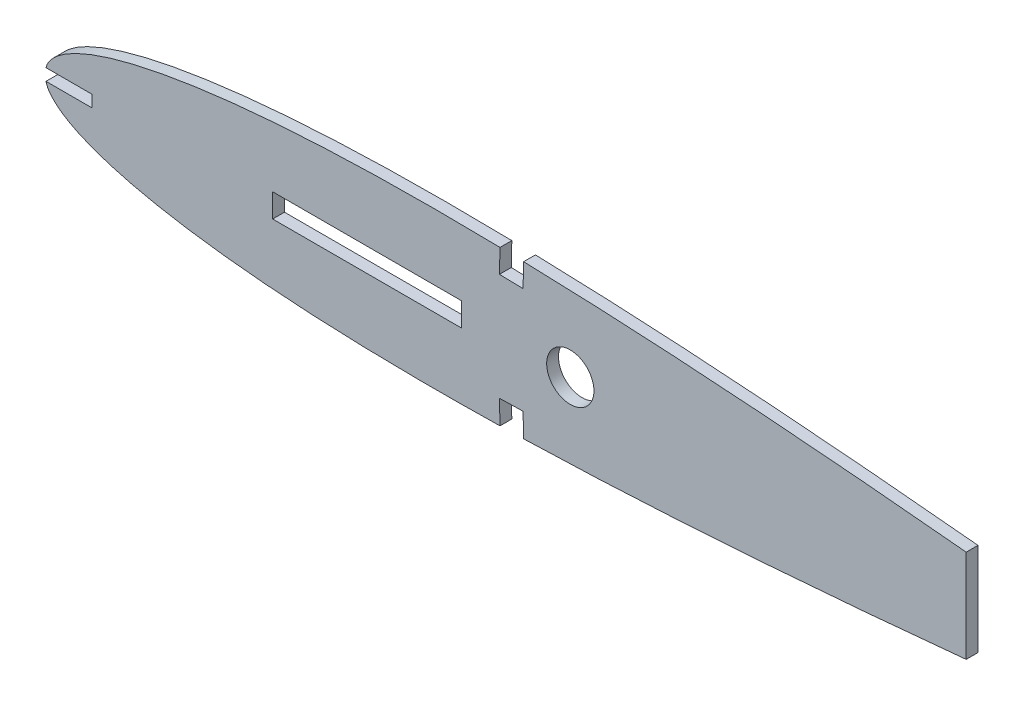
ISO-10303-21;
HEADER;
FILE_DESCRIPTION(('STEP AP214'),'2;1');
FILE_NAME('part.step','',(''),(''),'','','');
FILE_SCHEMA(('AUTOMOTIVE_DESIGN { 1 0 10303 214 1 1 1 1 }'));
ENDSEC;
DATA;
#1=APPLICATION_CONTEXT('core data for automotive mechanical design processes');
#2=APPLICATION_PROTOCOL_DEFINITION('international standard','automotive_design',2000,#1);
#3=PRODUCT_CONTEXT('',#1,'mechanical');
#4=PRODUCT('Part','Part','',(#3));
#5=PRODUCT_RELATED_PRODUCT_CATEGORY('part','',(#4));
#6=PRODUCT_DEFINITION_FORMATION('','',#4);
#7=PRODUCT_DEFINITION_CONTEXT('part definition',#1,'design');
#8=PRODUCT_DEFINITION('design','',#6,#7);
#9=PRODUCT_DEFINITION_SHAPE('','',#8);
#10=(LENGTH_UNIT() NAMED_UNIT(*) SI_UNIT(.MILLI.,.METRE.));
#11=(NAMED_UNIT(*) PLANE_ANGLE_UNIT() SI_UNIT($,.RADIAN.));
#12=(NAMED_UNIT(*) SI_UNIT($,.STERADIAN.) SOLID_ANGLE_UNIT());
#13=UNCERTAINTY_MEASURE_WITH_UNIT(LENGTH_MEASURE(1.E-05),#10,'distance_accuracy_value','');
#14=(GEOMETRIC_REPRESENTATION_CONTEXT(3) GLOBAL_UNCERTAINTY_ASSIGNED_CONTEXT((#13)) GLOBAL_UNIT_ASSIGNED_CONTEXT((#10,
#11,#12)) REPRESENTATION_CONTEXT('',''));
#15=CARTESIAN_POINT('',(0.,0.,0.));
#16=DIRECTION('',(0.,0.,1.));
#17=DIRECTION('',(1.,0.,0.));
#18=AXIS2_PLACEMENT_3D('',#15,#16,#17);
#19=CARTESIAN_POINT('',(0.,0.,3.175));
#20=CARTESIAN_POINT('',(0.115985534802059,-0.824823436018303,3.175));
#21=CARTESIAN_POINT('',(0.364862543708603,-2.59469577382463,3.175));
#22=CARTESIAN_POINT('',(2.22969317329404,-4.97424741823602,3.175));
#23=CARTESIAN_POINT('',(4.98137123964954,-7.17476356535342,3.175));
#24=CARTESIAN_POINT('',(8.77294159508805,-9.24947970106576,3.175));
#25=CARTESIAN_POINT('',(13.5435191774407,-11.2024906751345,3.175));
#26=CARTESIAN_POINT('',(19.2974960213887,-13.0205834501878,3.175));
#27=CARTESIAN_POINT('',(25.9988683661861,-14.6868250170778,3.175));
#28=CARTESIAN_POINT('',(33.6118170782071,-16.1849674426803,3.175));
#29=CARTESIAN_POINT('',(42.0909888876184,-17.4980708306289,3.175));
#30=CARTESIAN_POINT('',(51.3852334657118,-18.6124209383249,3.175));
#31=CARTESIAN_POINT('',(61.4378279271614,-19.5185362955799,3.175));
#32=CARTESIAN_POINT('',(72.1872792194382,-20.2093401026352,3.175));
#33=CARTESIAN_POINT('',(83.56751436261,-20.6827537764749,3.175));
#34=CARTESIAN_POINT('',(95.5084877266096,-20.9400156934708,3.175));
#35=CARTESIAN_POINT('',(107.936696619066,-20.9876471619785,3.175));
#36=CARTESIAN_POINT('',(120.775518049418,-20.8348485852232,3.175));
#37=CARTESIAN_POINT('',(133.946062727329,-20.4937461228791,3.175));
#38=CARTESIAN_POINT('',(147.366939386786,-19.981000511003,3.175));
#39=CARTESIAN_POINT('',(160.955791029869,-19.3133394364877,3.175));
#40=CARTESIAN_POINT('',(174.628693343563,-18.508566702671,3.175));
#41=CARTESIAN_POINT('',(188.301472832485,-17.5870138793066,3.175));
#42=CARTESIAN_POINT('',(201.889886046072,-16.5679498364445,3.175));
#43=CARTESIAN_POINT('',(215.310032455186,-15.470294327225,3.175));
#44=CARTESIAN_POINT('',(228.479451099162,-14.3119446099029,3.175));
#45=CARTESIAN_POINT('',(241.316804274559,-13.1122664299753,3.175));
#46=CARTESIAN_POINT('',(253.743033604296,-11.887008330919,3.175));
#47=CARTESIAN_POINT('',(265.681494766393,-10.6533719228195,3.175));
#48=CARTESIAN_POINT('',(277.058607360279,-9.42727111028594,3.175));
#49=CARTESIAN_POINT('',(287.804163994382,-8.22396630077346,3.175));
#50=CARTESIAN_POINT('',(297.851820226782,-7.0580399063066,3.175));
#51=CARTESIAN_POINT('',(307.139892382437,-5.94572982998584,3.175));
#52=CARTESIAN_POINT('',(315.610665982134,-4.89963732621521,3.175));
#53=CARTESIAN_POINT('',(323.213152208341,-3.93775159154104,3.175));
#54=CARTESIAN_POINT('',(329.896669994559,-3.064968775534,3.175));
#55=CARTESIAN_POINT('',(335.63166517205,-2.31918990164751,3.175));
#56=CARTESIAN_POINT('',(340.34887380594,-1.64076533548796,3.175));
#57=CARTESIAN_POINT('',(344.110866429769,-1.23133082569655,3.175));
#58=CARTESIAN_POINT('',(346.670763267733,-0.635287814967105,3.175));
#59=CARTESIAN_POINT('',(348.546486747565,-0.815947966453893,3.175));
#60=CARTESIAN_POINT('',(349.081845345648,-0.19502894621006,3.175));
#61=CARTESIAN_POINT('',(349.25,0.,3.175));
#62=B_SPLINE_CURVE_WITH_KNOTS('',3,(#19,#20,#21,#22,#23,#24,#25,#26,#27,#28,#29,#30,#31,#32,#33,
#34,#35,#36,#37,#38,#39,#40,#41,#42,#43,#44,#45,#46,#47,#48,#49,#50,#51,#52,#53,#54,#55,#56,#57,
#58,#59,#60,#61),.UNSPECIFIED.,.F.,.F.,(4,1,1,1,1,1,1,1,1,1,1,1,1,1,1,1,1,1,1,1,1,1,1,1,1,1,1,1,
1,1,1,1,1,1,1,1,1,1,1,1,4),(0.,0.00690887819095132,0.014824787780603,0.0245786747262124,
0.0365868011412138,0.0510270804082164,0.0679537271803132,0.0873481546665464,0.109150934661929,
0.133267944172764,0.159584673072264,0.187963463690011,0.218251704826384,0.250281930400473,
0.283870156733695,0.318821997747217,0.354933688380441,0.391987367731552,0.429762919657396,
0.468028540529623,0.506552783072523,0.545097780862577,0.583424682124698,0.621298850837664,
0.658483139040777,0.694749649104267,0.72987052691746,0.763629321442605,0.795816346106627,
0.826229711631338,0.85468110230924,0.880993609524026,0.90500122422466,0.92655519067439,
0.945518651994912,0.961773354231409,0.975215057817464,0.985759966117311,0.993340110835715,
0.997908147241042,1.),.UNSPECIFIED.);
#63=DIRECTION('',(0.,0.,-1.));
#64=VECTOR('',#63,1.);
#65=SURFACE_OF_LINEAR_EXTRUSION('',#62,#64);
#66=CARTESIAN_POINT('',(0.,0.,0.));
#67=CARTESIAN_POINT('',(0.115985534802059,-0.824823436018303,0.));
#68=CARTESIAN_POINT('',(0.364862543708603,-2.59469577382463,0.));
#69=CARTESIAN_POINT('',(2.22969317329404,-4.97424741823602,0.));
#70=CARTESIAN_POINT('',(4.98137123964954,-7.17476356535342,0.));
#71=CARTESIAN_POINT('',(8.77294159508805,-9.24947970106576,0.));
#72=CARTESIAN_POINT('',(13.5435191774407,-11.2024906751345,0.));
#73=CARTESIAN_POINT('',(19.2974960213887,-13.0205834501878,0.));
#74=CARTESIAN_POINT('',(25.9988683661861,-14.6868250170778,0.));
#75=CARTESIAN_POINT('',(33.6118170782071,-16.1849674426803,0.));
#76=CARTESIAN_POINT('',(42.0909888876184,-17.4980708306289,0.));
#77=CARTESIAN_POINT('',(51.3852334657118,-18.6124209383249,0.));
#78=CARTESIAN_POINT('',(61.4378279271614,-19.5185362955799,0.));
#79=CARTESIAN_POINT('',(72.1872792194382,-20.2093401026352,0.));
#80=CARTESIAN_POINT('',(83.56751436261,-20.6827537764749,0.));
#81=CARTESIAN_POINT('',(95.5084877266096,-20.9400156934708,0.));
#82=CARTESIAN_POINT('',(107.936696619066,-20.9876471619785,0.));
#83=CARTESIAN_POINT('',(120.775518049418,-20.8348485852232,0.));
#84=CARTESIAN_POINT('',(133.946062727329,-20.4937461228791,0.));
#85=CARTESIAN_POINT('',(147.366939386786,-19.981000511003,0.));
#86=CARTESIAN_POINT('',(160.955791029869,-19.3133394364877,0.));
#87=CARTESIAN_POINT('',(174.628693343563,-18.508566702671,0.));
#88=CARTESIAN_POINT('',(188.301472832485,-17.5870138793066,0.));
#89=CARTESIAN_POINT('',(201.889886046072,-16.5679498364445,0.));
#90=CARTESIAN_POINT('',(215.310032455186,-15.470294327225,0.));
#91=CARTESIAN_POINT('',(228.479451099162,-14.3119446099029,0.));
#92=CARTESIAN_POINT('',(241.316804274559,-13.1122664299753,0.));
#93=CARTESIAN_POINT('',(253.743033604296,-11.887008330919,0.));
#94=CARTESIAN_POINT('',(265.681494766393,-10.6533719228195,0.));
#95=CARTESIAN_POINT('',(277.058607360279,-9.42727111028594,0.));
#96=CARTESIAN_POINT('',(287.804163994382,-8.22396630077346,0.));
#97=CARTESIAN_POINT('',(297.851820226782,-7.0580399063066,0.));
#98=CARTESIAN_POINT('',(307.139892382437,-5.94572982998584,0.));
#99=CARTESIAN_POINT('',(315.610665982134,-4.89963732621521,0.));
#100=CARTESIAN_POINT('',(323.213152208341,-3.93775159154104,0.));
#101=CARTESIAN_POINT('',(329.896669994559,-3.064968775534,0.));
#102=CARTESIAN_POINT('',(335.63166517205,-2.31918990164751,0.));
#103=CARTESIAN_POINT('',(340.34887380594,-1.64076533548796,0.));
#104=CARTESIAN_POINT('',(344.110866429769,-1.23133082569655,0.));
#105=CARTESIAN_POINT('',(346.670763267733,-0.635287814967105,0.));
#106=CARTESIAN_POINT('',(348.546486747565,-0.815947966453893,0.));
#107=CARTESIAN_POINT('',(349.081845345648,-0.19502894621006,0.));
#108=CARTESIAN_POINT('',(349.25,0.,0.));
#109=B_SPLINE_CURVE_WITH_KNOTS('',3,(#66,#67,#68,#69,#70,#71,#72,#73,#74,#75,#76,#77,#78,#79,
#80,#81,#82,#83,#84,#85,#86,#87,#88,#89,#90,#91,#92,#93,#94,#95,#96,#97,#98,#99,#100,#101,#102,
#103,#104,#105,#106,#107,#108),.UNSPECIFIED.,.F.,.F.,(4,1,1,1,1,1,1,1,1,1,1,1,1,1,1,1,1,1,1,1,1,
1,1,1,1,1,1,1,1,1,1,1,1,1,1,1,1,1,1,1,4),(0.,0.00690887819095132,0.014824787780603,
0.0245786747262124,0.0365868011412138,0.0510270804082164,0.0679537271803132,0.0873481546665464,
0.109150934661929,0.133267944172764,0.159584673072264,0.187963463690011,0.218251704826384,
0.250281930400473,0.283870156733695,0.318821997747217,0.354933688380441,0.391987367731552,
0.429762919657396,0.468028540529623,0.506552783072523,0.545097780862577,0.583424682124698,
0.621298850837664,0.658483139040777,0.694749649104267,0.72987052691746,0.763629321442605,
0.795816346106627,0.826229711631338,0.85468110230924,0.880993609524026,0.90500122422466,
0.92655519067439,0.945518651994912,0.961773354231409,0.975215057817464,0.985759966117311,
0.993340110835715,0.997908147241042,1.),.UNSPECIFIED.);
#110=CARTESIAN_POINT('',(0.278181832771451,-1.5875,0.));
#111=VERTEX_POINT('',#110);
#112=CARTESIAN_POINT('',(122.327232824904,-20.7737889965541,0.));
#113=VERTEX_POINT('',#112);
#114=EDGE_CURVE('E375',#111,#113,#109,.T.);
#115=ORIENTED_EDGE('',*,*,#114,.T.);
#116=DIRECTION('',(0.,0.,-1.));
#117=VECTOR('',#116,1.);
#118=CARTESIAN_POINT('',(122.327232824903,-20.7737889965238,3.175));
#119=LINE('',#118,#117);
#120=CARTESIAN_POINT('',(122.327232824904,-20.7737889965541,3.175));
#121=VERTEX_POINT('',#120);
#122=EDGE_CURVE('E252',#113,#121,#119,.F.);
#123=ORIENTED_EDGE('',*,*,#122,.T.);
#124=CARTESIAN_POINT('',(0.278181832771451,-1.5875,3.175));
#125=VERTEX_POINT('',#124);
#126=EDGE_CURVE('E273',#125,#121,#62,.T.);
#127=ORIENTED_EDGE('',*,*,#126,.F.);
#128=DIRECTION('',(0.,0.,-1.));
#129=VECTOR('',#128,1.);
#130=CARTESIAN_POINT('',(0.27818183256063,-1.5875,3.175));
#131=LINE('',#130,#129);
#132=EDGE_CURVE('E204',#125,#111,#131,.T.);
#133=ORIENTED_EDGE('',*,*,#132,.T.);
#134=EDGE_LOOP('',(#115,#123,#127,#133));
#135=FACE_BOUND('',#134,.T.);
#136=ADVANCED_FACE('F47',(#135),#65,.F.);
#137=CARTESIAN_POINT('',(349.25,0.,3.175));
#138=CARTESIAN_POINT('',(349.081845345649,0.195028946210054,3.175));
#139=CARTESIAN_POINT('',(348.546486747564,0.815947966453887,3.175));
#140=CARTESIAN_POINT('',(346.670763267733,0.635287814967099,3.175));
#141=CARTESIAN_POINT('',(344.110866429769,1.23133082569654,3.175));
#142=CARTESIAN_POINT('',(340.34887380594,1.64076533548795,3.175));
#143=CARTESIAN_POINT('',(335.63166517205,2.3191899016475,3.175));
#144=CARTESIAN_POINT('',(329.896669994558,3.06496877553399,3.175));
#145=CARTESIAN_POINT('',(323.213152208341,3.93775159154102,3.175));
#146=CARTESIAN_POINT('',(315.610665982132,4.8996373262152,3.175));
#147=CARTESIAN_POINT('',(307.139892382437,5.94572982998583,3.175));
#148=CARTESIAN_POINT('',(297.851820226782,7.05803990630659,3.175));
#149=CARTESIAN_POINT('',(287.804163994382,8.22396630077345,3.175));
#150=CARTESIAN_POINT('',(277.058607360279,9.42727111028591,3.175));
#151=CARTESIAN_POINT('',(265.681494766393,10.6533719228194,3.175));
#152=CARTESIAN_POINT('',(253.743033604296,11.887008330919,3.175));
#153=CARTESIAN_POINT('',(241.316804274558,13.1122664299753,3.175));
#154=CARTESIAN_POINT('',(228.479451099162,14.3119446099029,3.175));
#155=CARTESIAN_POINT('',(215.310032455185,15.470294327225,3.175));
#156=CARTESIAN_POINT('',(201.889886046072,16.5679498364445,3.175));
#157=CARTESIAN_POINT('',(188.301472832485,17.5870138793065,3.175));
#158=CARTESIAN_POINT('',(174.628693343563,18.5085667026709,3.175));
#159=CARTESIAN_POINT('',(160.955791029868,19.3133394364876,3.175));
#160=CARTESIAN_POINT('',(147.366939386786,19.9810005110029,3.175));
#161=CARTESIAN_POINT('',(133.946062727329,20.4937461228791,3.175));
#162=CARTESIAN_POINT('',(120.775518049417,20.8348485852232,3.175));
#163=CARTESIAN_POINT('',(107.936696619066,20.9876471619784,3.175));
#164=CARTESIAN_POINT('',(95.5084877266094,20.9400156934707,3.175));
#165=CARTESIAN_POINT('',(83.5675143626098,20.6827537764748,3.175));
#166=CARTESIAN_POINT('',(72.187279219438,20.2093401026351,3.175));
#167=CARTESIAN_POINT('',(61.4378279271613,19.5185362955799,3.175));
#168=CARTESIAN_POINT('',(51.3852334657117,18.6124209383248,3.175));
#169=CARTESIAN_POINT('',(42.0909888876183,17.4980708306289,3.175));
#170=CARTESIAN_POINT('',(33.611817078207,16.1849674426803,3.175));
#171=CARTESIAN_POINT('',(25.9988683661861,14.6868250170778,3.175));
#172=CARTESIAN_POINT('',(19.2974960213886,13.0205834501878,3.175));
#173=CARTESIAN_POINT('',(13.5435191774407,11.2024906751345,3.175));
#174=CARTESIAN_POINT('',(8.77294159508802,9.24947970106573,3.175));
#175=CARTESIAN_POINT('',(4.98137123964953,7.17476356535341,3.175));
#176=CARTESIAN_POINT('',(2.22969317329403,4.97424741823602,3.175));
#177=CARTESIAN_POINT('',(0.364862543708601,2.59469577382463,3.175));
#178=CARTESIAN_POINT('',(0.115985534802059,0.824823436018293,3.175));
#179=CARTESIAN_POINT('',(0.,0.,3.175));
#180=B_SPLINE_CURVE_WITH_KNOTS('',3,(#137,#138,#139,#140,#141,#142,#143,#144,#145,#146,#147,
#148,#149,#150,#151,#152,#153,#154,#155,#156,#157,#158,#159,#160,#161,#162,#163,#164,#165,#166,
#167,#168,#169,#170,#171,#172,#173,#174,#175,#176,#177,#178,#179),.UNSPECIFIED.,.F.,.F.,(4,1,1,
1,1,1,1,1,1,1,1,1,1,1,1,1,1,1,1,1,1,1,1,1,1,1,1,1,1,1,1,1,1,1,1,1,1,1,1,1,4),(0.,
0.00209185275895771,0.00665988916428452,0.0142400338826894,0.0247849421825357,
0.0382266457685912,0.0544813480050881,0.0734448093256102,0.0949987757753401,0.119006390475974,
0.14531889769076,0.173770288368662,0.204183653893373,0.236370678557395,0.27012947308254,
0.305250350895733,0.341516860959223,0.378701149162336,0.416575317875302,0.454902219137423,
0.493447216927477,0.531971459470377,0.570237080342604,0.608012632268448,0.645066311619559,
0.681178002252783,0.716129843266305,0.749718069599527,0.781748295173616,0.812036536309989,
0.840415326927736,0.866732055827236,0.890849065338071,0.912651845333454,0.932046272819687,
0.948972919591784,0.963413198858786,0.975421325273788,0.985175212219397,0.993091121809049,1.),.UNSPECIFIED.);
#181=DIRECTION('',(0.,0.,-1.));
#182=VECTOR('',#181,1.);
#183=SURFACE_OF_LINEAR_EXTRUSION('',#180,#182);
#184=CARTESIAN_POINT('',(247.65,12.485229976577,3.175));
#185=VERTEX_POINT('',#184);
#186=CARTESIAN_POINT('',(128.675427044537,20.6223619520034,3.175));
#187=VERTEX_POINT('',#186);
#188=EDGE_CURVE('E284',#185,#187,#180,.T.);
#189=ORIENTED_EDGE('',*,*,#188,.F.);
#190=DIRECTION('',(0.,0.,-1.));
#191=VECTOR('',#190,1.);
#192=CARTESIAN_POINT('',(247.65,12.4852299762647,3.175));
#193=LINE('',#192,#191);
#194=CARTESIAN_POINT('',(247.65,12.485229976577,0.));
#195=VERTEX_POINT('',#194);
#196=EDGE_CURVE('E261',#185,#195,#193,.T.);
#197=ORIENTED_EDGE('',*,*,#196,.T.);
#198=CARTESIAN_POINT('',(349.25,0.,0.));
#199=CARTESIAN_POINT('',(349.081845345649,0.195028946210054,0.));
#200=CARTESIAN_POINT('',(348.546486747564,0.815947966453887,0.));
#201=CARTESIAN_POINT('',(346.670763267733,0.635287814967099,0.));
#202=CARTESIAN_POINT('',(344.110866429769,1.23133082569654,0.));
#203=CARTESIAN_POINT('',(340.34887380594,1.64076533548795,0.));
#204=CARTESIAN_POINT('',(335.63166517205,2.3191899016475,0.));
#205=CARTESIAN_POINT('',(329.896669994558,3.06496877553399,0.));
#206=CARTESIAN_POINT('',(323.213152208341,3.93775159154102,0.));
#207=CARTESIAN_POINT('',(315.610665982132,4.8996373262152,0.));
#208=CARTESIAN_POINT('',(307.139892382437,5.94572982998583,0.));
#209=CARTESIAN_POINT('',(297.851820226782,7.05803990630659,0.));
#210=CARTESIAN_POINT('',(287.804163994382,8.22396630077345,0.));
#211=CARTESIAN_POINT('',(277.058607360279,9.42727111028591,0.));
#212=CARTESIAN_POINT('',(265.681494766393,10.6533719228194,0.));
#213=CARTESIAN_POINT('',(253.743033604296,11.887008330919,0.));
#214=CARTESIAN_POINT('',(241.316804274558,13.1122664299753,0.));
#215=CARTESIAN_POINT('',(228.479451099162,14.3119446099029,0.));
#216=CARTESIAN_POINT('',(215.310032455185,15.470294327225,0.));
#217=CARTESIAN_POINT('',(201.889886046072,16.5679498364445,0.));
#218=CARTESIAN_POINT('',(188.301472832485,17.5870138793065,0.));
#219=CARTESIAN_POINT('',(174.628693343563,18.5085667026709,0.));
#220=CARTESIAN_POINT('',(160.955791029868,19.3133394364876,0.));
#221=CARTESIAN_POINT('',(147.366939386786,19.9810005110029,0.));
#222=CARTESIAN_POINT('',(133.946062727329,20.4937461228791,0.));
#223=CARTESIAN_POINT('',(120.775518049417,20.8348485852232,0.));
#224=CARTESIAN_POINT('',(107.936696619066,20.9876471619784,0.));
#225=CARTESIAN_POINT('',(95.5084877266094,20.9400156934707,0.));
#226=CARTESIAN_POINT('',(83.5675143626098,20.6827537764748,0.));
#227=CARTESIAN_POINT('',(72.187279219438,20.2093401026351,0.));
#228=CARTESIAN_POINT('',(61.4378279271613,19.5185362955799,0.));
#229=CARTESIAN_POINT('',(51.3852334657117,18.6124209383248,0.));
#230=CARTESIAN_POINT('',(42.0909888876183,17.4980708306289,0.));
#231=CARTESIAN_POINT('',(33.611817078207,16.1849674426803,0.));
#232=CARTESIAN_POINT('',(25.9988683661861,14.6868250170778,0.));
#233=CARTESIAN_POINT('',(19.2974960213886,13.0205834501878,0.));
#234=CARTESIAN_POINT('',(13.5435191774407,11.2024906751345,0.));
#235=CARTESIAN_POINT('',(8.77294159508802,9.24947970106573,0.));
#236=CARTESIAN_POINT('',(4.98137123964953,7.17476356535341,0.));
#237=CARTESIAN_POINT('',(2.22969317329403,4.97424741823602,0.));
#238=CARTESIAN_POINT('',(0.364862543708601,2.59469577382463,0.));
#239=CARTESIAN_POINT('',(0.115985534802059,0.824823436018293,0.));
#240=CARTESIAN_POINT('',(0.,0.,0.));
#241=B_SPLINE_CURVE_WITH_KNOTS('',3,(#198,#199,#200,#201,#202,#203,#204,#205,#206,#207,#208,
#209,#210,#211,#212,#213,#214,#215,#216,#217,#218,#219,#220,#221,#222,#223,#224,#225,#226,#227,
#228,#229,#230,#231,#232,#233,#234,#235,#236,#237,#238,#239,#240),.UNSPECIFIED.,.F.,.F.,(4,1,1,
1,1,1,1,1,1,1,1,1,1,1,1,1,1,1,1,1,1,1,1,1,1,1,1,1,1,1,1,1,1,1,1,1,1,1,1,1,4),(0.,
0.00209185275895771,0.00665988916428452,0.0142400338826894,0.0247849421825357,
0.0382266457685912,0.0544813480050881,0.0734448093256102,0.0949987757753401,0.119006390475974,
0.14531889769076,0.173770288368662,0.204183653893373,0.236370678557395,0.27012947308254,
0.305250350895733,0.341516860959223,0.378701149162336,0.416575317875302,0.454902219137423,
0.493447216927477,0.531971459470377,0.570237080342604,0.608012632268448,0.645066311619559,
0.681178002252783,0.716129843266305,0.749718069599527,0.781748295173616,0.812036536309989,
0.840415326927736,0.866732055827236,0.890849065338071,0.912651845333454,0.932046272819687,
0.948972919591784,0.963413198858786,0.975421325273788,0.985175212219397,0.993091121809049,1.),.UNSPECIFIED.);
#242=CARTESIAN_POINT('',(128.675427044537,20.6223619520034,0.));
#243=VERTEX_POINT('',#242);
#244=EDGE_CURVE('E274',#195,#243,#241,.T.);
#245=ORIENTED_EDGE('',*,*,#244,.T.);
#246=DIRECTION('',(0.,0.,-1.));
#247=VECTOR('',#246,1.);
#248=CARTESIAN_POINT('',(128.675427044536,20.6223619519876,3.175));
#249=LINE('',#248,#247);
#250=EDGE_CURVE('E258',#243,#187,#249,.F.);
#251=ORIENTED_EDGE('',*,*,#250,.T.);
#252=EDGE_LOOP('',(#189,#197,#245,#251));
#253=FACE_BOUND('',#252,.T.);
#254=ADVANCED_FACE('F295',(#253),#183,.F.);
#255=CARTESIAN_POINT('',(128.675427044536,-20.6223619519876,0.));
#256=VERTEX_POINT('',#255);
#257=CARTESIAN_POINT('',(247.650000009448,-12.4852299753336,0.));
#258=VERTEX_POINT('',#257);
#259=EDGE_CURVE('E266',#256,#258,#109,.T.);
#260=ORIENTED_EDGE('',*,*,#259,.T.);
#261=DIRECTION('',(0.,0.,-1.));
#262=VECTOR('',#261,1.);
#263=CARTESIAN_POINT('',(247.65,-12.4852299762648,3.175));
#264=LINE('',#263,#262);
#265=CARTESIAN_POINT('',(247.65,-12.4852299753336,3.175));
#266=VERTEX_POINT('',#265);
#267=EDGE_CURVE('E264',#258,#266,#264,.F.);
#268=ORIENTED_EDGE('',*,*,#267,.T.);
#269=CARTESIAN_POINT('',(128.675427044536,-20.6223619519876,3.175));
#270=VERTEX_POINT('',#269);
#271=EDGE_CURVE('E267',#270,#266,#62,.T.);
#272=ORIENTED_EDGE('',*,*,#271,.F.);
#273=DIRECTION('',(0.,0.,-1.));
#274=VECTOR('',#273,1.);
#275=CARTESIAN_POINT('',(128.675427044536,-20.6223619519876,3.175));
#276=LINE('',#275,#274);
#277=EDGE_CURVE('E249',#270,#256,#276,.T.);
#278=ORIENTED_EDGE('',*,*,#277,.T.);
#279=EDGE_LOOP('',(#260,#268,#272,#278));
#280=FACE_BOUND('',#279,.T.);
#281=ADVANCED_FACE('F49',(#280),#65,.F.);
#282=CARTESIAN_POINT('',(122.327232824903,20.7737889965008,3.175));
#283=VERTEX_POINT('',#282);
#284=CARTESIAN_POINT('',(0.278181832771451,1.5875,3.175));
#285=VERTEX_POINT('',#284);
#286=EDGE_CURVE('E275',#283,#285,#180,.T.);
#287=ORIENTED_EDGE('',*,*,#286,.F.);
#288=DIRECTION('',(0.,0.,-1.));
#289=VECTOR('',#288,1.);
#290=CARTESIAN_POINT('',(122.327232824903,20.7737889965238,3.175));
#291=LINE('',#290,#289);
#292=CARTESIAN_POINT('',(122.327232824903,20.7737889965008,0.));
#293=VERTEX_POINT('',#292);
#294=EDGE_CURVE('E255',#283,#293,#291,.T.);
#295=ORIENTED_EDGE('',*,*,#294,.T.);
#296=CARTESIAN_POINT('',(0.278181832771451,1.5875,0.));
#297=VERTEX_POINT('',#296);
#298=EDGE_CURVE('E376',#293,#297,#241,.T.);
#299=ORIENTED_EDGE('',*,*,#298,.T.);
#300=DIRECTION('',(0.,0.,-1.));
#301=VECTOR('',#300,1.);
#302=CARTESIAN_POINT('',(0.278181832560628,1.58749999999999,3.175));
#303=LINE('',#302,#301);
#304=EDGE_CURVE('E245',#297,#285,#303,.F.);
#305=ORIENTED_EDGE('',*,*,#304,.T.);
#306=EDGE_LOOP('',(#287,#295,#299,#305));
#307=FACE_BOUND('',#306,.T.);
#308=ADVANCED_FACE('F291',(#307),#183,.F.);
#309=CARTESIAN_POINT('',(172.295032653064,-18.6346740274407,3.175));
#310=DIRECTION('',(0.,0.,1.));
#311=DIRECTION('',(1.,0.,0.));
#312=AXIS2_PLACEMENT_3D('',#309,#310,#311);
#313=PLANE('',#312);
#314=DIRECTION('',(0.,-1.,0.));
#315=VECTOR('',#314,1.);
#316=CARTESIAN_POINT('',(61.214,3.175,3.175));
#317=LINE('',#316,#315);
#318=CARTESIAN_POINT('',(61.214,3.175,3.175));
#319=VERTEX_POINT('',#318);
#320=CARTESIAN_POINT('',(61.214,-3.175,3.175));
#321=VERTEX_POINT('',#320);
#322=EDGE_CURVE('E63',#319,#321,#317,.T.);
#323=ORIENTED_EDGE('',*,*,#322,.F.);
#324=DIRECTION('',(-1.,0.,0.));
#325=VECTOR('',#324,1.);
#326=CARTESIAN_POINT('',(61.214,3.175,3.175));
#327=LINE('',#326,#325);
#328=CARTESIAN_POINT('',(112.014,3.175,3.175));
#329=VERTEX_POINT('',#328);
#330=EDGE_CURVE('E192',#329,#319,#327,.T.);
#331=ORIENTED_EDGE('',*,*,#330,.F.);
#332=DIRECTION('',(0.,1.,0.));
#333=VECTOR('',#332,1.);
#334=CARTESIAN_POINT('',(112.014,3.175,3.175));
#335=LINE('',#334,#333);
#336=CARTESIAN_POINT('',(112.014,-3.175,3.175));
#337=VERTEX_POINT('',#336);
#338=EDGE_CURVE('E176',#337,#329,#335,.T.);
#339=ORIENTED_EDGE('',*,*,#338,.F.);
#340=DIRECTION('',(1.,0.,0.));
#341=VECTOR('',#340,1.);
#342=CARTESIAN_POINT('',(61.214,-3.175,3.175));
#343=LINE('',#342,#341);
#344=EDGE_CURVE('E185',#321,#337,#343,.T.);
#345=ORIENTED_EDGE('',*,*,#344,.F.);
#346=EDGE_LOOP('',(#323,#331,#339,#345));
#347=FACE_BOUND('',#346,.T.);
#348=DIRECTION('',(0.,-1.,0.));
#349=VECTOR('',#348,1.);
#350=CARTESIAN_POINT('',(247.65,50.8,3.175));
#351=LINE('',#350,#349);
#352=EDGE_CURVE('E202',#185,#266,#351,.T.);
#353=ORIENTED_EDGE('',*,*,#352,.F.);
#354=ORIENTED_EDGE('',*,*,#188,.T.);
#355=DIRECTION('',(0.0238467786671199,0.99971562513907,0.));
#356=VECTOR('',#355,1.);
#357=CARTESIAN_POINT('',(128.675427044536,20.6223619519876,3.175));
#358=LINE('',#357,#356);
#359=CARTESIAN_POINT('',(128.524,14.2741677323545,3.175));
#360=VERTEX_POINT('',#359);
#361=EDGE_CURVE('E225',#360,#187,#358,.T.);
#362=ORIENTED_EDGE('',*,*,#361,.F.);
#363=DIRECTION('',(0.99971562513907,-0.0238467786671225,0.));
#364=VECTOR('',#363,1.);
#365=CARTESIAN_POINT('',(128.524,14.2741677323545,3.175));
#366=LINE('',#365,#364);
#367=CARTESIAN_POINT('',(122.175805780367,14.4255947768907,3.175));
#368=VERTEX_POINT('',#367);
#369=EDGE_CURVE('E222',#368,#360,#366,.T.);
#370=ORIENTED_EDGE('',*,*,#369,.F.);
#371=DIRECTION('',(-0.0238467786671209,-0.99971562513907,0.));
#372=VECTOR('',#371,1.);
#373=CARTESIAN_POINT('',(122.175805780367,14.4255947768907,3.175));
#374=LINE('',#373,#372);
#375=EDGE_CURVE('E199',#283,#368,#374,.T.);
#376=ORIENTED_EDGE('',*,*,#375,.F.);
#377=ORIENTED_EDGE('',*,*,#286,.T.);
#378=DIRECTION('',(-1.,0.,0.));
#379=VECTOR('',#378,1.);
#380=CARTESIAN_POINT('',(0.,1.5875,3.175));
#381=LINE('',#380,#379);
#382=CARTESIAN_POINT('',(12.7,1.5875,3.175));
#383=VERTEX_POINT('',#382);
#384=EDGE_CURVE('E236',#383,#285,#381,.T.);
#385=ORIENTED_EDGE('',*,*,#384,.F.);
#386=DIRECTION('',(0.,1.,0.));
#387=VECTOR('',#386,1.);
#388=CARTESIAN_POINT('',(12.7,1.5875,3.175));
#389=LINE('',#388,#387);
#390=CARTESIAN_POINT('',(12.7,-1.5875,3.175));
#391=VERTEX_POINT('',#390);
#392=EDGE_CURVE('E233',#391,#383,#389,.T.);
#393=ORIENTED_EDGE('',*,*,#392,.F.);
#394=DIRECTION('',(1.,0.,0.));
#395=VECTOR('',#394,1.);
#396=CARTESIAN_POINT('',(0.,-1.5875,3.175));
#397=LINE('',#396,#395);
#398=EDGE_CURVE('E230',#125,#391,#397,.T.);
#399=ORIENTED_EDGE('',*,*,#398,.F.);
#400=ORIENTED_EDGE('',*,*,#126,.T.);
#401=DIRECTION('',(0.023846778667122,-0.99971562513907,0.));
#402=VECTOR('',#401,1.);
#403=CARTESIAN_POINT('',(122.327232824903,-20.7737889965238,3.175));
#404=LINE('',#403,#402);
#405=CARTESIAN_POINT('',(122.175805780367,-14.4255947768907,3.175));
#406=VERTEX_POINT('',#405);
#407=EDGE_CURVE('E213',#406,#121,#404,.T.);
#408=ORIENTED_EDGE('',*,*,#407,.F.);
#409=DIRECTION('',(-0.99971562513907,-0.0238467786671225,0.));
#410=VECTOR('',#409,1.);
#411=CARTESIAN_POINT('',(128.524,-14.2741677323545,3.175));
#412=LINE('',#411,#410);
#413=CARTESIAN_POINT('',(128.524,-14.2741677323545,3.175));
#414=VERTEX_POINT('',#413);
#415=EDGE_CURVE('E209',#414,#406,#412,.T.);
#416=ORIENTED_EDGE('',*,*,#415,.F.);
#417=DIRECTION('',(-0.0238467786671209,0.99971562513907,0.));
#418=VECTOR('',#417,1.);
#419=CARTESIAN_POINT('',(128.675427044536,-20.6223619519876,3.175));
#420=LINE('',#419,#418);
#421=EDGE_CURVE('E206',#270,#414,#420,.T.);
#422=ORIENTED_EDGE('',*,*,#421,.F.);
#423=ORIENTED_EDGE('',*,*,#271,.T.);
#424=EDGE_LOOP('',(#353,#354,#362,#370,#376,#377,#385,#393,#399,#400,#408,#416,#422,#423));
#425=FACE_BOUND('',#424,.T.);
#426=CARTESIAN_POINT('',(141.224,0.,3.175));
#427=DIRECTION('',(0.,0.,1.));
#428=DIRECTION('',(1.,0.,0.));
#429=AXIS2_PLACEMENT_3D('',#426,#427,#428);
#430=CIRCLE('',#429,6.35);
#431=CARTESIAN_POINT('',(147.574,0.,3.175));
#432=VERTEX_POINT('',#431);
#433=EDGE_CURVE('E218',#432,#432,#430,.T.);
#434=ORIENTED_EDGE('',*,*,#433,.F.);
#435=EDGE_LOOP('',(#434));
#436=FACE_BOUND('',#435,.T.);
#437=ADVANCED_FACE('F189',(#347,#425,#436),#313,.T.);
#438=CARTESIAN_POINT('',(172.295032653064,-18.6346740274407,0.));
#439=DIRECTION('',(0.,0.,1.));
#440=DIRECTION('',(1.,0.,0.));
#441=AXIS2_PLACEMENT_3D('',#438,#439,#440);
#442=PLANE('',#441);
#443=DIRECTION('',(-1.,0.,0.));
#444=VECTOR('',#443,1.);
#445=CARTESIAN_POINT('',(172.295032653064,3.175,0.));
#446=LINE('',#445,#444);
#447=CARTESIAN_POINT('',(112.014,3.175,0.));
#448=VERTEX_POINT('',#447);
#449=CARTESIAN_POINT('',(61.214,3.175,0.));
#450=VERTEX_POINT('',#449);
#451=EDGE_CURVE('E56',#448,#450,#446,.T.);
#452=ORIENTED_EDGE('',*,*,#451,.T.);
#453=DIRECTION('',(0.,-1.,0.));
#454=VECTOR('',#453,1.);
#455=CARTESIAN_POINT('',(61.214,-18.6346740274407,0.));
#456=LINE('',#455,#454);
#457=CARTESIAN_POINT('',(61.214,-3.175,0.));
#458=VERTEX_POINT('',#457);
#459=EDGE_CURVE('E11',#450,#458,#456,.T.);
#460=ORIENTED_EDGE('',*,*,#459,.T.);
#461=DIRECTION('',(1.,0.,0.));
#462=VECTOR('',#461,1.);
#463=CARTESIAN_POINT('',(172.295032653064,-3.175,0.));
#464=LINE('',#463,#462);
#465=CARTESIAN_POINT('',(112.014,-3.175,0.));
#466=VERTEX_POINT('',#465);
#467=EDGE_CURVE('E417',#458,#466,#464,.T.);
#468=ORIENTED_EDGE('',*,*,#467,.T.);
#469=DIRECTION('',(0.,1.,0.));
#470=VECTOR('',#469,1.);
#471=CARTESIAN_POINT('',(112.014,-18.6346740274407,0.));
#472=LINE('',#471,#470);
#473=EDGE_CURVE('E179',#466,#448,#472,.T.);
#474=ORIENTED_EDGE('',*,*,#473,.T.);
#475=EDGE_LOOP('',(#452,#460,#468,#474));
#476=FACE_BOUND('',#475,.T.);
#477=CARTESIAN_POINT('',(141.224,0.,0.));
#478=DIRECTION('',(0.,0.,1.));
#479=DIRECTION('',(1.,0.,0.));
#480=AXIS2_PLACEMENT_3D('',#477,#478,#479);
#481=CIRCLE('',#480,6.35);
#482=CARTESIAN_POINT('',(147.574,0.,0.));
#483=VERTEX_POINT('',#482);
#484=EDGE_CURVE('E248',#483,#483,#481,.T.);
#485=ORIENTED_EDGE('',*,*,#484,.T.);
#486=EDGE_LOOP('',(#485));
#487=FACE_BOUND('',#486,.T.);
#488=ORIENTED_EDGE('',*,*,#244,.F.);
#489=DIRECTION('',(0.,-1.,0.));
#490=VECTOR('',#489,1.);
#491=CARTESIAN_POINT('',(247.65,-18.6346740274407,0.));
#492=LINE('',#491,#490);
#493=EDGE_CURVE('E415',#195,#258,#492,.T.);
#494=ORIENTED_EDGE('',*,*,#493,.T.);
#495=ORIENTED_EDGE('',*,*,#259,.F.);
#496=DIRECTION('',(-0.0238467786671209,0.99971562513907,0.));
#497=VECTOR('',#496,1.);
#498=CARTESIAN_POINT('',(128.652845680977,-19.6756956410897,0.));
#499=LINE('',#498,#497);
#500=CARTESIAN_POINT('',(128.524,-14.2741677323545,0.));
#501=VERTEX_POINT('',#500);
#502=EDGE_CURVE('E396',#256,#501,#499,.T.);
#503=ORIENTED_EDGE('',*,*,#502,.T.);
#504=DIRECTION('',(-0.99971562513907,-0.0238467786671225,0.));
#505=VECTOR('',#504,1.);
#506=CARTESIAN_POINT('',(172.166186972087,-13.2331461187054,0.));
#507=LINE('',#506,#505);
#508=CARTESIAN_POINT('',(122.175805780367,-14.4255947768907,0.));
#509=VERTEX_POINT('',#508);
#510=EDGE_CURVE('E400',#501,#509,#507,.T.);
#511=ORIENTED_EDGE('',*,*,#510,.T.);
#512=DIRECTION('',(0.023846778667122,-0.99971562513907,0.));
#513=VECTOR('',#512,1.);
#514=CARTESIAN_POINT('',(122.304651461343,-19.827122685626,0.));
#515=LINE('',#514,#513);
#516=EDGE_CURVE('E403',#509,#113,#515,.T.);
#517=ORIENTED_EDGE('',*,*,#516,.T.);
#518=ORIENTED_EDGE('',*,*,#114,.F.);
#519=DIRECTION('',(1.,0.,0.));
#520=VECTOR('',#519,1.);
#521=CARTESIAN_POINT('',(172.295032653064,-1.5875,0.));
#522=LINE('',#521,#520);
#523=CARTESIAN_POINT('',(12.7,-1.5875,0.));
#524=VERTEX_POINT('',#523);
#525=EDGE_CURVE('E384',#111,#524,#522,.T.);
#526=ORIENTED_EDGE('',*,*,#525,.T.);
#527=DIRECTION('',(0.,1.,0.));
#528=VECTOR('',#527,1.);
#529=CARTESIAN_POINT('',(12.7,-18.6346740274407,0.));
#530=LINE('',#529,#528);
#531=CARTESIAN_POINT('',(12.7,1.5875,0.));
#532=VERTEX_POINT('',#531);
#533=EDGE_CURVE('E390',#524,#532,#530,.T.);
#534=ORIENTED_EDGE('',*,*,#533,.T.);
#535=DIRECTION('',(-1.,0.,0.));
#536=VECTOR('',#535,1.);
#537=CARTESIAN_POINT('',(172.295032653064,1.58749999999999,0.));
#538=LINE('',#537,#536);
#539=EDGE_CURVE('E393',#532,#297,#538,.T.);
#540=ORIENTED_EDGE('',*,*,#539,.T.);
#541=ORIENTED_EDGE('',*,*,#298,.F.);
#542=DIRECTION('',(-0.0238467786671209,-0.99971562513907,0.));
#543=VECTOR('',#542,1.);
#544=CARTESIAN_POINT('',(121.416150306476,-17.4210314518524,0.));
#545=LINE('',#544,#543);
#546=CARTESIAN_POINT('',(122.175805780367,14.4255947768907,0.));
#547=VERTEX_POINT('',#546);
#548=EDGE_CURVE('E406',#293,#547,#545,.T.);
#549=ORIENTED_EDGE('',*,*,#548,.T.);
#550=DIRECTION('',(0.99971562513907,-0.0238467786671225,0.));
#551=VECTOR('',#550,1.);
#552=CARTESIAN_POINT('',(173.054688126955,13.2119522013024,0.));
#553=LINE('',#552,#551);
#554=CARTESIAN_POINT('',(128.524,14.2741677323545,0.));
#555=VERTEX_POINT('',#554);
#556=EDGE_CURVE('E409',#547,#555,#553,.T.);
#557=ORIENTED_EDGE('',*,*,#556,.T.);
#558=DIRECTION('',(0.0238467786671199,0.99971562513907,0.));
#559=VECTOR('',#558,1.);
#560=CARTESIAN_POINT('',(127.764344526109,-17.5724584963887,0.));
#561=LINE('',#560,#559);
#562=EDGE_CURVE('E412',#555,#243,#561,.T.);
#563=ORIENTED_EDGE('',*,*,#562,.T.);
#564=EDGE_LOOP('',(#488,#494,#495,#503,#511,#517,#518,#526,#534,#540,#541,#549,#557,#563));
#565=FACE_BOUND('',#564,.T.);
#566=ADVANCED_FACE('F296',(#476,#487,#565),#442,.F.);
#567=CARTESIAN_POINT('',(0.,1.5875,-1.905));
#568=DIRECTION('',(0.,1.,0.));
#569=DIRECTION('',(-1.,0.,0.));
#570=AXIS2_PLACEMENT_3D('',#567,#568,#569);
#571=PLANE('',#570);
#572=ORIENTED_EDGE('',*,*,#539,.F.);
#573=DIRECTION('',(0.,0.,1.));
#574=VECTOR('',#573,1.);
#575=CARTESIAN_POINT('',(12.7,1.5875,-1.905));
#576=LINE('',#575,#574);
#577=EDGE_CURVE('E205',#532,#383,#576,.T.);
#578=ORIENTED_EDGE('',*,*,#577,.T.);
#579=ORIENTED_EDGE('',*,*,#384,.T.);
#580=ORIENTED_EDGE('',*,*,#304,.F.);
#581=EDGE_LOOP('',(#572,#578,#579,#580));
#582=FACE_BOUND('',#581,.T.);
#583=ADVANCED_FACE('F299',(#582),#571,.F.);
#584=CARTESIAN_POINT('',(12.7,1.5875,-1.905));
#585=DIRECTION('',(1.,0.,0.));
#586=DIRECTION('',(0.,1.,0.));
#587=AXIS2_PLACEMENT_3D('',#584,#585,#586);
#588=PLANE('',#587);
#589=DIRECTION('',(0.,0.,1.));
#590=VECTOR('',#589,1.);
#591=CARTESIAN_POINT('',(12.7,-1.5875,-1.905));
#592=LINE('',#591,#590);
#593=EDGE_CURVE('E238',#524,#391,#592,.T.);
#594=ORIENTED_EDGE('',*,*,#593,.T.);
#595=ORIENTED_EDGE('',*,*,#392,.T.);
#596=ORIENTED_EDGE('',*,*,#577,.F.);
#597=ORIENTED_EDGE('',*,*,#533,.F.);
#598=EDGE_LOOP('',(#594,#595,#596,#597));
#599=FACE_BOUND('',#598,.T.);
#600=ADVANCED_FACE('F311',(#599),#588,.F.);
#601=CARTESIAN_POINT('',(0.,-1.5875,-1.905));
#602=DIRECTION('',(0.,-1.,0.));
#603=DIRECTION('',(0.,0.,-1.));
#604=AXIS2_PLACEMENT_3D('',#601,#602,#603);
#605=PLANE('',#604);
#606=ORIENTED_EDGE('',*,*,#398,.T.);
#607=ORIENTED_EDGE('',*,*,#593,.F.);
#608=ORIENTED_EDGE('',*,*,#525,.F.);
#609=ORIENTED_EDGE('',*,*,#132,.F.);
#610=EDGE_LOOP('',(#606,#607,#608,#609));
#611=FACE_BOUND('',#610,.T.);
#612=ADVANCED_FACE('F307',(#611),#605,.F.);
#613=CARTESIAN_POINT('',(141.224,0.,-1.905));
#614=DIRECTION('',(0.,0.,1.));
#615=DIRECTION('',(1.,0.,0.));
#616=AXIS2_PLACEMENT_3D('',#613,#614,#615);
#617=CYLINDRICAL_SURFACE('',#616,6.35);
#618=ORIENTED_EDGE('',*,*,#433,.T.);
#619=EDGE_LOOP('',(#618));
#620=FACE_BOUND('',#619,.T.);
#621=ORIENTED_EDGE('',*,*,#484,.F.);
#622=EDGE_LOOP('',(#621));
#623=FACE_BOUND('',#622,.T.);
#624=ADVANCED_FACE('F303',(#620,#623),#617,.F.);
#625=CARTESIAN_POINT('',(122.327232824903,-20.7737889965238,-1.905));
#626=DIRECTION('',(-0.99971562513907,-0.023846778667122,0.));
#627=DIRECTION('',(0.023846778667122,-0.99971562513907,0.));
#628=AXIS2_PLACEMENT_3D('',#625,#626,#627);
#629=PLANE('',#628);
#630=ORIENTED_EDGE('',*,*,#516,.F.);
#631=DIRECTION('',(0.,0.,1.));
#632=VECTOR('',#631,1.);
#633=CARTESIAN_POINT('',(122.175805780367,-14.4255947768907,-1.905));
#634=LINE('',#633,#632);
#635=EDGE_CURVE('E216',#509,#406,#634,.T.);
#636=ORIENTED_EDGE('',*,*,#635,.T.);
#637=ORIENTED_EDGE('',*,*,#407,.T.);
#638=ORIENTED_EDGE('',*,*,#122,.F.);
#639=EDGE_LOOP('',(#630,#636,#637,#638));
#640=FACE_BOUND('',#639,.T.);
#641=ADVANCED_FACE('F306',(#640),#629,.F.);
#642=CARTESIAN_POINT('',(128.524,-14.2741677323545,-1.905));
#643=DIRECTION('',(-0.0238467786671225,0.99971562513907,0.));
#644=DIRECTION('',(-0.99971562513907,-0.0238467786671225,0.));
#645=AXIS2_PLACEMENT_3D('',#642,#643,#644);
#646=PLANE('',#645);
#647=DIRECTION('',(0.,0.,1.));
#648=VECTOR('',#647,1.);
#649=CARTESIAN_POINT('',(128.524,-14.2741677323545,-1.905));
#650=LINE('',#649,#648);
#651=EDGE_CURVE('E215',#501,#414,#650,.T.);
#652=ORIENTED_EDGE('',*,*,#651,.T.);
#653=ORIENTED_EDGE('',*,*,#415,.T.);
#654=ORIENTED_EDGE('',*,*,#635,.F.);
#655=ORIENTED_EDGE('',*,*,#510,.F.);
#656=EDGE_LOOP('',(#652,#653,#654,#655));
#657=FACE_BOUND('',#656,.T.);
#658=ADVANCED_FACE('F335',(#657),#646,.F.);
#659=CARTESIAN_POINT('',(128.675427044536,-20.6223619519876,-1.905));
#660=DIRECTION('',(0.99971562513907,0.0238467786671209,0.));
#661=DIRECTION('',(-0.0238467786671209,0.99971562513907,0.));
#662=AXIS2_PLACEMENT_3D('',#659,#660,#661);
#663=PLANE('',#662);
#664=ORIENTED_EDGE('',*,*,#421,.T.);
#665=ORIENTED_EDGE('',*,*,#651,.F.);
#666=ORIENTED_EDGE('',*,*,#502,.F.);
#667=ORIENTED_EDGE('',*,*,#277,.F.);
#668=EDGE_LOOP('',(#664,#665,#666,#667));
#669=FACE_BOUND('',#668,.T.);
#670=ADVANCED_FACE('F331',(#669),#663,.F.);
#671=CARTESIAN_POINT('',(128.675427044536,20.6223619519876,-1.905));
#672=DIRECTION('',(0.99971562513907,-0.0238467786671199,0.));
#673=DIRECTION('',(0.0238467786671199,0.99971562513907,0.));
#674=AXIS2_PLACEMENT_3D('',#671,#672,#673);
#675=PLANE('',#674);
#676=ORIENTED_EDGE('',*,*,#562,.F.);
#677=DIRECTION('',(0.,0.,1.));
#678=VECTOR('',#677,1.);
#679=CARTESIAN_POINT('',(128.524,14.2741677323545,-1.905));
#680=LINE('',#679,#678);
#681=EDGE_CURVE('E210',#555,#360,#680,.T.);
#682=ORIENTED_EDGE('',*,*,#681,.T.);
#683=ORIENTED_EDGE('',*,*,#361,.T.);
#684=ORIENTED_EDGE('',*,*,#250,.F.);
#685=EDGE_LOOP('',(#676,#682,#683,#684));
#686=FACE_BOUND('',#685,.T.);
#687=ADVANCED_FACE('F327',(#686),#675,.F.);
#688=CARTESIAN_POINT('',(128.524,14.2741677323545,-1.905));
#689=DIRECTION('',(-0.0238467786671225,-0.99971562513907,0.));
#690=DIRECTION('',(0.99971562513907,-0.0238467786671225,0.));
#691=AXIS2_PLACEMENT_3D('',#688,#689,#690);
#692=PLANE('',#691);
#693=DIRECTION('',(0.,0.,1.));
#694=VECTOR('',#693,1.);
#695=CARTESIAN_POINT('',(122.175805780367,14.4255947768907,-1.905));
#696=LINE('',#695,#694);
#697=EDGE_CURVE('E227',#547,#368,#696,.T.);
#698=ORIENTED_EDGE('',*,*,#697,.T.);
#699=ORIENTED_EDGE('',*,*,#369,.T.);
#700=ORIENTED_EDGE('',*,*,#681,.F.);
#701=ORIENTED_EDGE('',*,*,#556,.F.);
#702=EDGE_LOOP('',(#698,#699,#700,#701));
#703=FACE_BOUND('',#702,.T.);
#704=ADVANCED_FACE('F323',(#703),#692,.F.);
#705=CARTESIAN_POINT('',(122.175805780367,14.4255947768907,-1.905));
#706=DIRECTION('',(-0.99971562513907,0.0238467786671209,0.));
#707=DIRECTION('',(-0.0238467786671209,-0.99971562513907,0.));
#708=AXIS2_PLACEMENT_3D('',#705,#706,#707);
#709=PLANE('',#708);
#710=ORIENTED_EDGE('',*,*,#375,.T.);
#711=ORIENTED_EDGE('',*,*,#697,.F.);
#712=ORIENTED_EDGE('',*,*,#548,.F.);
#713=ORIENTED_EDGE('',*,*,#294,.F.);
#714=EDGE_LOOP('',(#710,#711,#712,#713));
#715=FACE_BOUND('',#714,.T.);
#716=ADVANCED_FACE('F319',(#715),#709,.F.);
#717=CARTESIAN_POINT('',(247.65,50.8,-1.905));
#718=DIRECTION('',(-1.,0.,0.));
#719=DIRECTION('',(0.,0.,1.));
#720=AXIS2_PLACEMENT_3D('',#717,#718,#719);
#721=PLANE('',#720);
#722=ORIENTED_EDGE('',*,*,#493,.F.);
#723=ORIENTED_EDGE('',*,*,#196,.F.);
#724=ORIENTED_EDGE('',*,*,#352,.T.);
#725=ORIENTED_EDGE('',*,*,#267,.F.);
#726=EDGE_LOOP('',(#722,#723,#724,#725));
#727=FACE_BOUND('',#726,.T.);
#728=ADVANCED_FACE('F322',(#727),#721,.F.);
#729=CARTESIAN_POINT('',(61.214,3.175,-1.905));
#730=DIRECTION('',(-1.,0.,0.));
#731=DIRECTION('',(0.,0.,1.));
#732=AXIS2_PLACEMENT_3D('',#729,#730,#731);
#733=PLANE('',#732);
#734=DIRECTION('',(0.,0.,1.));
#735=VECTOR('',#734,1.);
#736=CARTESIAN_POINT('',(61.214,3.175,-1.905));
#737=LINE('',#736,#735);
#738=EDGE_CURVE('E197',#450,#319,#737,.T.);
#739=ORIENTED_EDGE('',*,*,#738,.T.);
#740=ORIENTED_EDGE('',*,*,#322,.T.);
#741=DIRECTION('',(0.,0.,1.));
#742=VECTOR('',#741,1.);
#743=CARTESIAN_POINT('',(61.214,-3.175,-1.905));
#744=LINE('',#743,#742);
#745=EDGE_CURVE('E182',#458,#321,#744,.T.);
#746=ORIENTED_EDGE('',*,*,#745,.F.);
#747=ORIENTED_EDGE('',*,*,#459,.F.);
#748=EDGE_LOOP('',(#739,#740,#746,#747));
#749=FACE_BOUND('',#748,.T.);
#750=ADVANCED_FACE('F345',(#749),#733,.F.);
#751=CARTESIAN_POINT('',(61.214,3.175,-1.905));
#752=DIRECTION('',(0.,1.,0.));
#753=DIRECTION('',(0.,0.,1.));
#754=AXIS2_PLACEMENT_3D('',#751,#752,#753);
#755=PLANE('',#754);
#756=DIRECTION('',(0.,0.,1.));
#757=VECTOR('',#756,1.);
#758=CARTESIAN_POINT('',(112.014,3.175,-1.905));
#759=LINE('',#758,#757);
#760=EDGE_CURVE('E181',#448,#329,#759,.T.);
#761=ORIENTED_EDGE('',*,*,#760,.T.);
#762=ORIENTED_EDGE('',*,*,#330,.T.);
#763=ORIENTED_EDGE('',*,*,#738,.F.);
#764=ORIENTED_EDGE('',*,*,#451,.F.);
#765=EDGE_LOOP('',(#761,#762,#763,#764));
#766=FACE_BOUND('',#765,.T.);
#767=ADVANCED_FACE('F349',(#766),#755,.F.);
#768=CARTESIAN_POINT('',(112.014,3.175,-1.905));
#769=DIRECTION('',(1.,0.,0.));
#770=DIRECTION('',(0.,0.,-1.));
#771=AXIS2_PLACEMENT_3D('',#768,#769,#770);
#772=PLANE('',#771);
#773=DIRECTION('',(0.,0.,1.));
#774=VECTOR('',#773,1.);
#775=CARTESIAN_POINT('',(112.014,-3.175,-1.905));
#776=LINE('',#775,#774);
#777=EDGE_CURVE('E71',#466,#337,#776,.T.);
#778=ORIENTED_EDGE('',*,*,#777,.T.);
#779=ORIENTED_EDGE('',*,*,#338,.T.);
#780=ORIENTED_EDGE('',*,*,#760,.F.);
#781=ORIENTED_EDGE('',*,*,#473,.F.);
#782=EDGE_LOOP('',(#778,#779,#780,#781));
#783=FACE_BOUND('',#782,.T.);
#784=ADVANCED_FACE('F173',(#783),#772,.F.);
#785=CARTESIAN_POINT('',(61.214,-3.175,-1.905));
#786=DIRECTION('',(0.,-1.,0.));
#787=DIRECTION('',(0.,0.,-1.));
#788=AXIS2_PLACEMENT_3D('',#785,#786,#787);
#789=PLANE('',#788);
#790=ORIENTED_EDGE('',*,*,#745,.T.);
#791=ORIENTED_EDGE('',*,*,#344,.T.);
#792=ORIENTED_EDGE('',*,*,#777,.F.);
#793=ORIENTED_EDGE('',*,*,#467,.F.);
#794=EDGE_LOOP('',(#790,#791,#792,#793));
#795=FACE_BOUND('',#794,.T.);
#796=ADVANCED_FACE('F186',(#795),#789,.F.);
#797=CLOSED_SHELL('',(#136,#254,#281,#308,#437,#566,#583,#600,#612,#624,#641,#658,#670,#687,
#704,#716,#728,#750,#767,#784,#796));
#798=MANIFOLD_SOLID_BREP('B2',#797);
#799=ADVANCED_BREP_SHAPE_REPRESENTATION('',(#18,#798),#14);
#800=SHAPE_DEFINITION_REPRESENTATION(#9,#799);
ENDSEC;
END-ISO-10303-21;
